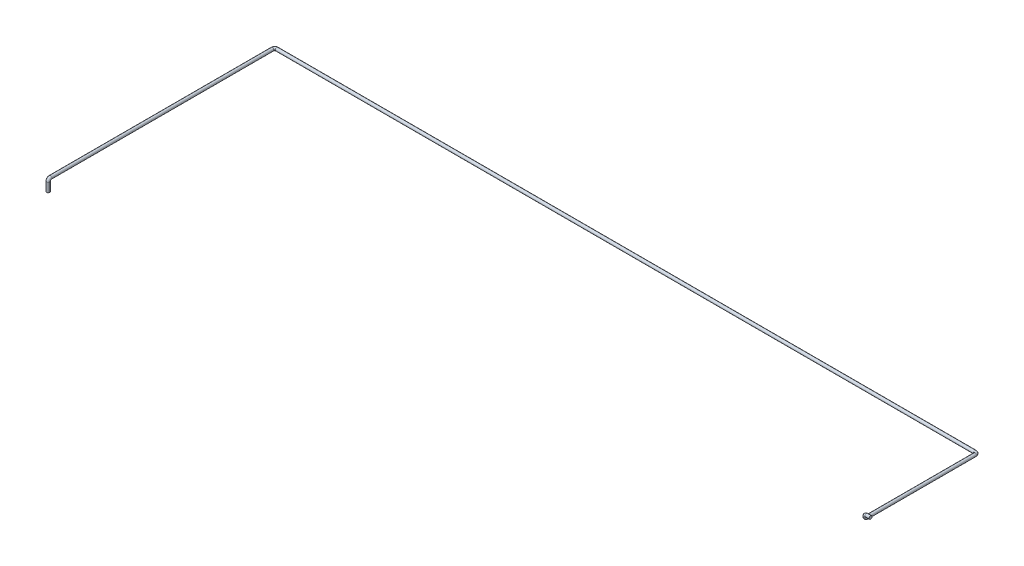
ISO-10303-21;
HEADER;
FILE_DESCRIPTION(('STEP AP214'),'2;1');
FILE_NAME('part.step','',(''),(''),'','','');
FILE_SCHEMA(('AUTOMOTIVE_DESIGN { 1 0 10303 214 1 1 1 1 }'));
ENDSEC;
DATA;
#1=APPLICATION_CONTEXT('core data for automotive mechanical design processes');
#2=APPLICATION_PROTOCOL_DEFINITION('international standard','automotive_design',2000,#1);
#3=PRODUCT_CONTEXT('',#1,'mechanical');
#4=PRODUCT('Part','Part','',(#3));
#5=PRODUCT_RELATED_PRODUCT_CATEGORY('part','',(#4));
#6=PRODUCT_DEFINITION_FORMATION('','',#4);
#7=PRODUCT_DEFINITION_CONTEXT('part definition',#1,'design');
#8=PRODUCT_DEFINITION('design','',#6,#7);
#9=PRODUCT_DEFINITION_SHAPE('','',#8);
#10=(LENGTH_UNIT() NAMED_UNIT(*) SI_UNIT(.MILLI.,.METRE.));
#11=(NAMED_UNIT(*) PLANE_ANGLE_UNIT() SI_UNIT($,.RADIAN.));
#12=(NAMED_UNIT(*) SI_UNIT($,.STERADIAN.) SOLID_ANGLE_UNIT());
#13=UNCERTAINTY_MEASURE_WITH_UNIT(LENGTH_MEASURE(1.E-05),#10,'distance_accuracy_value','');
#14=(GEOMETRIC_REPRESENTATION_CONTEXT(3) GLOBAL_UNCERTAINTY_ASSIGNED_CONTEXT((#13)) GLOBAL_UNIT_ASSIGNED_CONTEXT((#10,
#11,#12)) REPRESENTATION_CONTEXT('',''));
#15=CARTESIAN_POINT('',(0.,0.,0.));
#16=DIRECTION('',(0.,0.,1.));
#17=DIRECTION('',(1.,0.,0.));
#18=AXIS2_PLACEMENT_3D('',#15,#16,#17);
#19=CARTESIAN_POINT('',(0.,0.,0.));
#20=DIRECTION('',(1.,0.,0.));
#21=DIRECTION('',(0.,0.,-1.));
#22=AXIS2_PLACEMENT_3D('',#19,#20,#21);
#23=PLANE('',#22);
#24=CARTESIAN_POINT('',(0.,0.,0.));
#25=DIRECTION('',(1.,0.,0.));
#26=DIRECTION('',(0.,0.,-1.));
#27=AXIS2_PLACEMENT_3D('',#24,#25,#26);
#28=CIRCLE('',#27,13.7);
#29=CARTESIAN_POINT('',(0.,0.,-13.7));
#30=VERTEX_POINT('',#29);
#31=EDGE_CURVE('E47',#30,#30,#28,.T.);
#32=ORIENTED_EDGE('',*,*,#31,.T.);
#33=EDGE_LOOP('',(#32));
#34=FACE_BOUND('',#33,.T.);
#35=ADVANCED_FACE('F35',(#34),#23,.T.);
#36=CARTESIAN_POINT('',(-6315.,-130.,1020.));
#37=DIRECTION('',(0.,1.,0.));
#38=DIRECTION('',(0.,0.,1.));
#39=AXIS2_PLACEMENT_3D('',#36,#37,#38);
#40=PLANE('',#39);
#41=CARTESIAN_POINT('',(-6315.,-130.,1020.));
#42=DIRECTION('',(0.,1.,0.));
#43=DIRECTION('',(0.,0.,1.));
#44=AXIS2_PLACEMENT_3D('',#41,#42,#43);
#45=CIRCLE('',#44,13.7);
#46=CARTESIAN_POINT('',(-6315.,-130.,1033.7));
#47=VERTEX_POINT('',#46);
#48=EDGE_CURVE('E11',#47,#47,#45,.T.);
#49=ORIENTED_EDGE('',*,*,#48,.F.);
#50=EDGE_LOOP('',(#49));
#51=FACE_BOUND('',#50,.T.);
#52=ADVANCED_FACE('F53',(#51),#40,.F.);
#53=CARTESIAN_POINT('',(0.,0.,0.));
#54=DIRECTION('',(-1.,0.,0.));
#55=DIRECTION('',(0.,0.,1.));
#56=AXIS2_PLACEMENT_3D('',#53,#54,#55);
#57=CYLINDRICAL_SURFACE('',#56,13.7);
#58=CARTESIAN_POINT('',(-36.,0.,0.));
#59=DIRECTION('',(1.,0.,0.));
#60=DIRECTION('',(0.,0.,-1.));
#61=AXIS2_PLACEMENT_3D('',#58,#59,#60);
#62=CIRCLE('',#61,13.7);
#63=CARTESIAN_POINT('',(-36.,13.7,0.));
#64=VERTEX_POINT('',#63);
#65=EDGE_CURVE('E111',#64,#64,#62,.T.);
#66=ORIENTED_EDGE('',*,*,#65,.T.);
#67=EDGE_LOOP('',(#66));
#68=FACE_BOUND('',#67,.T.);
#69=ORIENTED_EDGE('',*,*,#31,.F.);
#70=EDGE_LOOP('',(#69));
#71=FACE_BOUND('',#70,.T.);
#72=ADVANCED_FACE('F55',(#68,#71),#57,.T.);
#73=CARTESIAN_POINT('',(-36.,-14.,0.));
#74=DIRECTION('',(0.,0.,1.));
#75=DIRECTION('',(1.,0.,0.));
#76=AXIS2_PLACEMENT_3D('',#73,#74,#75);
#77=TOROIDAL_SURFACE('',#76,14.,13.7);
#78=CARTESIAN_POINT('',(-50.,-14.,0.));
#79=DIRECTION('',(0.,1.,0.));
#80=DIRECTION('',(0.,0.,-1.));
#81=AXIS2_PLACEMENT_3D('',#78,#79,#80);
#82=CIRCLE('',#81,13.7);
#83=CARTESIAN_POINT('',(-63.7,-14.,0.));
#84=VERTEX_POINT('',#83);
#85=EDGE_CURVE('E108',#84,#84,#82,.T.);
#86=CARTESIAN_POINT('',(-36.,-14.,0.));
#87=DIRECTION('',(0.,0.,1.));
#88=DIRECTION('',(1.,0.,0.));
#89=AXIS2_PLACEMENT_3D('',#86,#87,#88);
#90=CIRCLE('',#89,27.7);
#91=EDGE_CURVE('',#64,#84,#90,.T.);
#92=ORIENTED_EDGE('',*,*,#65,.F.);
#93=ORIENTED_EDGE('',*,*,#85,.T.);
#94=ORIENTED_EDGE('',*,*,#91,.T.);
#95=ORIENTED_EDGE('',*,*,#91,.F.);
#96=EDGE_LOOP('',(#92,#94,#93,#95));
#97=FACE_BOUND('',#96,.T.);
#98=ADVANCED_FACE('F60',(#97),#77,.T.);
#99=CARTESIAN_POINT('',(-50.,-14.,0.));
#100=DIRECTION('',(0.,-1.,0.));
#101=DIRECTION('',(0.,0.,-1.));
#102=AXIS2_PLACEMENT_3D('',#99,#100,#101);
#103=CYLINDRICAL_SURFACE('',#102,13.7);
#104=CARTESIAN_POINT('',(-50.,-16.,0.));
#105=DIRECTION('',(0.,1.,0.));
#106=DIRECTION('',(0.,0.,-1.));
#107=AXIS2_PLACEMENT_3D('',#104,#105,#106);
#108=CIRCLE('',#107,13.7);
#109=CARTESIAN_POINT('',(-50.,-16.,13.7));
#110=VERTEX_POINT('',#109);
#111=EDGE_CURVE('E113',#110,#110,#108,.T.);
#112=ORIENTED_EDGE('',*,*,#111,.T.);
#113=EDGE_LOOP('',(#112));
#114=FACE_BOUND('',#113,.T.);
#115=ORIENTED_EDGE('',*,*,#85,.F.);
#116=EDGE_LOOP('',(#115));
#117=FACE_BOUND('',#116,.T.);
#118=ADVANCED_FACE('F96',(#114,#117),#103,.T.);
#119=CARTESIAN_POINT('',(-50.,-16.,-14.));
#120=DIRECTION('',(1.,0.,0.));
#121=DIRECTION('',(0.,0.,-1.));
#122=AXIS2_PLACEMENT_3D('',#119,#120,#121);
#123=TOROIDAL_SURFACE('',#122,14.,13.7);
#124=CARTESIAN_POINT('',(-50.,-30.,-14.));
#125=DIRECTION('',(0.,0.,1.));
#126=DIRECTION('',(0.,1.,0.));
#127=AXIS2_PLACEMENT_3D('',#124,#125,#126);
#128=CIRCLE('',#127,13.7);
#129=CARTESIAN_POINT('',(-50.,-43.7,-14.));
#130=VERTEX_POINT('',#129);
#131=EDGE_CURVE('E119',#130,#130,#128,.T.);
#132=CARTESIAN_POINT('',(-50.,-16.,-14.));
#133=DIRECTION('',(1.,0.,0.));
#134=DIRECTION('',(0.,0.,-1.));
#135=AXIS2_PLACEMENT_3D('',#132,#133,#134);
#136=CIRCLE('',#135,27.7);
#137=EDGE_CURVE('',#110,#130,#136,.T.);
#138=ORIENTED_EDGE('',*,*,#111,.F.);
#139=ORIENTED_EDGE('',*,*,#131,.T.);
#140=ORIENTED_EDGE('',*,*,#137,.T.);
#141=ORIENTED_EDGE('',*,*,#137,.F.);
#142=EDGE_LOOP('',(#138,#140,#139,#141));
#143=FACE_BOUND('',#142,.T.);
#144=ADVANCED_FACE('F92',(#143),#123,.T.);
#145=CARTESIAN_POINT('',(-50.,-30.,-14.));
#146=DIRECTION('',(0.,0.,-1.));
#147=DIRECTION('',(0.,1.,0.));
#148=AXIS2_PLACEMENT_3D('',#145,#146,#147);
#149=CYLINDRICAL_SURFACE('',#148,13.7);
#150=CARTESIAN_POINT('',(-50.,-29.9999999999998,-980.));
#151=DIRECTION('',(0.,0.,1.));
#152=DIRECTION('',(0.,1.,0.));
#153=AXIS2_PLACEMENT_3D('',#150,#151,#152);
#154=CIRCLE('',#153,13.7);
#155=CARTESIAN_POINT('',(-36.3,-29.9999999999998,-980.));
#156=VERTEX_POINT('',#155);
#157=EDGE_CURVE('E122',#156,#156,#154,.T.);
#158=ORIENTED_EDGE('',*,*,#157,.T.);
#159=EDGE_LOOP('',(#158));
#160=FACE_BOUND('',#159,.T.);
#161=ORIENTED_EDGE('',*,*,#131,.F.);
#162=EDGE_LOOP('',(#161));
#163=FACE_BOUND('',#162,.T.);
#164=ADVANCED_FACE('F88',(#160,#163),#149,.T.);
#165=CARTESIAN_POINT('',(-70.,-29.9999999999998,-980.));
#166=DIRECTION('',(0.,1.,0.));
#167=DIRECTION('',(0.,0.,1.));
#168=AXIS2_PLACEMENT_3D('',#165,#166,#167);
#169=TOROIDAL_SURFACE('',#168,20.,13.7);
#170=CARTESIAN_POINT('',(-70.,-29.9999999999998,-1000.));
#171=DIRECTION('',(1.,0.,0.));
#172=DIRECTION('',(0.,1.,0.));
#173=AXIS2_PLACEMENT_3D('',#170,#171,#172);
#174=CIRCLE('',#173,13.7);
#175=CARTESIAN_POINT('',(-70.,-29.9999999999998,-1013.7));
#176=VERTEX_POINT('',#175);
#177=EDGE_CURVE('E125',#176,#176,#174,.T.);
#178=CARTESIAN_POINT('',(-70.,-29.9999999999998,-980.));
#179=DIRECTION('',(0.,1.,0.));
#180=DIRECTION('',(0.,0.,1.));
#181=AXIS2_PLACEMENT_3D('',#178,#179,#180);
#182=CIRCLE('',#181,33.7);
#183=EDGE_CURVE('',#156,#176,#182,.T.);
#184=ORIENTED_EDGE('',*,*,#157,.F.);
#185=ORIENTED_EDGE('',*,*,#177,.T.);
#186=ORIENTED_EDGE('',*,*,#183,.T.);
#187=ORIENTED_EDGE('',*,*,#183,.F.);
#188=EDGE_LOOP('',(#184,#186,#185,#187));
#189=FACE_BOUND('',#188,.T.);
#190=ADVANCED_FACE('F84',(#189),#169,.T.);
#191=CARTESIAN_POINT('',(-70.,-29.9999999999998,-1000.));
#192=DIRECTION('',(-1.,0.,0.));
#193=DIRECTION('',(0.,0.,1.));
#194=AXIS2_PLACEMENT_3D('',#191,#192,#193);
#195=CYLINDRICAL_SURFACE('',#194,13.7);
#196=CARTESIAN_POINT('',(-6295.,-29.9999999999998,-1000.));
#197=DIRECTION('',(1.,0.,0.));
#198=DIRECTION('',(0.,1.,0.));
#199=AXIS2_PLACEMENT_3D('',#196,#197,#198);
#200=CIRCLE('',#199,13.7);
#201=CARTESIAN_POINT('',(-6295.,-29.9999999999998,-1013.7));
#202=VERTEX_POINT('',#201);
#203=EDGE_CURVE('E128',#202,#202,#200,.T.);
#204=ORIENTED_EDGE('',*,*,#203,.T.);
#205=EDGE_LOOP('',(#204));
#206=FACE_BOUND('',#205,.T.);
#207=ORIENTED_EDGE('',*,*,#177,.F.);
#208=EDGE_LOOP('',(#207));
#209=FACE_BOUND('',#208,.T.);
#210=ADVANCED_FACE('F80',(#206,#209),#195,.T.);
#211=CARTESIAN_POINT('',(-6295.,-29.9999999999998,-980.));
#212=DIRECTION('',(0.,1.,0.));
#213=DIRECTION('',(0.,0.,1.));
#214=AXIS2_PLACEMENT_3D('',#211,#212,#213);
#215=TOROIDAL_SURFACE('',#214,19.9999999999998,13.7);
#216=CARTESIAN_POINT('',(-6315.,-29.9999999999998,-980.));
#217=DIRECTION('',(0.,0.,-1.));
#218=DIRECTION('',(0.,1.,0.));
#219=AXIS2_PLACEMENT_3D('',#216,#217,#218);
#220=CIRCLE('',#219,13.7);
#221=CARTESIAN_POINT('',(-6328.7,-29.9999999999998,-980.));
#222=VERTEX_POINT('',#221);
#223=EDGE_CURVE('E131',#222,#222,#220,.T.);
#224=CARTESIAN_POINT('',(-6295.,-29.9999999999998,-980.));
#225=DIRECTION('',(0.,1.,0.));
#226=DIRECTION('',(0.,0.,1.));
#227=AXIS2_PLACEMENT_3D('',#224,#225,#226);
#228=CIRCLE('',#227,33.6999999999998);
#229=EDGE_CURVE('',#202,#222,#228,.T.);
#230=ORIENTED_EDGE('',*,*,#203,.F.);
#231=ORIENTED_EDGE('',*,*,#223,.T.);
#232=ORIENTED_EDGE('',*,*,#229,.T.);
#233=ORIENTED_EDGE('',*,*,#229,.F.);
#234=EDGE_LOOP('',(#230,#232,#231,#233));
#235=FACE_BOUND('',#234,.T.);
#236=ADVANCED_FACE('F76',(#235),#215,.T.);
#237=CARTESIAN_POINT('',(-6315.,-29.9999999999998,-980.));
#238=DIRECTION('',(0.,0.,1.));
#239=DIRECTION('',(1.,0.,0.));
#240=AXIS2_PLACEMENT_3D('',#237,#238,#239);
#241=CYLINDRICAL_SURFACE('',#240,13.7);
#242=CARTESIAN_POINT('',(-6315.,-29.9999999999998,1000.));
#243=DIRECTION('',(0.,0.,-1.));
#244=DIRECTION('',(0.,1.,0.));
#245=AXIS2_PLACEMENT_3D('',#242,#243,#244);
#246=CIRCLE('',#245,13.7);
#247=CARTESIAN_POINT('',(-6315.,-16.2999999999998,1000.));
#248=VERTEX_POINT('',#247);
#249=EDGE_CURVE('E134',#248,#248,#246,.T.);
#250=ORIENTED_EDGE('',*,*,#249,.T.);
#251=EDGE_LOOP('',(#250));
#252=FACE_BOUND('',#251,.T.);
#253=ORIENTED_EDGE('',*,*,#223,.F.);
#254=EDGE_LOOP('',(#253));
#255=FACE_BOUND('',#254,.T.);
#256=ADVANCED_FACE('F70',(#252,#255),#241,.T.);
#257=CARTESIAN_POINT('',(-6315.,-49.9999999999998,1000.));
#258=DIRECTION('',(1.,0.,0.));
#259=DIRECTION('',(0.,0.,-1.));
#260=AXIS2_PLACEMENT_3D('',#257,#258,#259);
#261=TOROIDAL_SURFACE('',#260,20.,13.7);
#262=CARTESIAN_POINT('',(-6315.,-49.9999999999998,1020.));
#263=DIRECTION('',(0.,1.,0.));
#264=DIRECTION('',(0.,0.,1.));
#265=AXIS2_PLACEMENT_3D('',#262,#263,#264);
#266=CIRCLE('',#265,13.7);
#267=CARTESIAN_POINT('',(-6315.,-49.9999999999998,1033.7));
#268=VERTEX_POINT('',#267);
#269=EDGE_CURVE('E42',#268,#268,#266,.T.);
#270=CARTESIAN_POINT('',(-6315.,-49.9999999999998,1000.));
#271=DIRECTION('',(1.,0.,0.));
#272=DIRECTION('',(0.,0.,-1.));
#273=AXIS2_PLACEMENT_3D('',#270,#271,#272);
#274=CIRCLE('',#273,33.7);
#275=EDGE_CURVE('',#248,#268,#274,.T.);
#276=ORIENTED_EDGE('',*,*,#249,.F.);
#277=ORIENTED_EDGE('',*,*,#269,.T.);
#278=ORIENTED_EDGE('',*,*,#275,.T.);
#279=ORIENTED_EDGE('',*,*,#275,.F.);
#280=EDGE_LOOP('',(#276,#278,#277,#279));
#281=FACE_BOUND('',#280,.T.);
#282=ADVANCED_FACE('F66',(#281),#261,.T.);
#283=CARTESIAN_POINT('',(-6315.,-49.9999999999998,1020.));
#284=DIRECTION('',(0.,-1.,0.));
#285=DIRECTION('',(0.,0.,-1.));
#286=AXIS2_PLACEMENT_3D('',#283,#284,#285);
#287=CYLINDRICAL_SURFACE('',#286,13.7);
#288=ORIENTED_EDGE('',*,*,#48,.T.);
#289=EDGE_LOOP('',(#288));
#290=FACE_BOUND('',#289,.T.);
#291=ORIENTED_EDGE('',*,*,#269,.F.);
#292=EDGE_LOOP('',(#291));
#293=FACE_BOUND('',#292,.T.);
#294=ADVANCED_FACE('F50',(#290,#293),#287,.T.);
#295=CLOSED_SHELL('',(#35,#52,#72,#98,#118,#144,#164,#190,#210,#236,#256,#282,#294));
#296=MANIFOLD_SOLID_BREP('B2',#295);
#297=ADVANCED_BREP_SHAPE_REPRESENTATION('',(#18,#296),#14);
#298=SHAPE_DEFINITION_REPRESENTATION(#9,#297);
ENDSEC;
END-ISO-10303-21;
